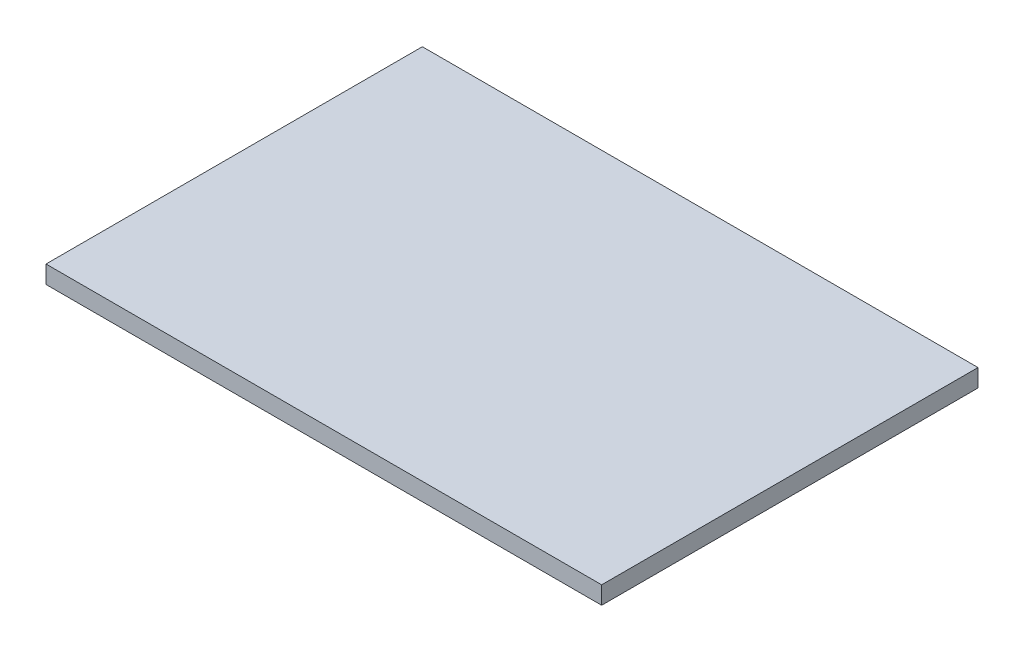
ISO-10303-21;
HEADER;
FILE_DESCRIPTION(('STEP AP214'),'2;1');
FILE_NAME('part.step','',(''),(''),'','','');
FILE_SCHEMA(('AUTOMOTIVE_DESIGN { 1 0 10303 214 1 1 1 1 }'));
ENDSEC;
DATA;
#1=APPLICATION_CONTEXT('core data for automotive mechanical design processes');
#2=APPLICATION_PROTOCOL_DEFINITION('international standard','automotive_design',2000,#1);
#3=PRODUCT_CONTEXT('',#1,'mechanical');
#4=PRODUCT('Part','Part','',(#3));
#5=PRODUCT_RELATED_PRODUCT_CATEGORY('part','',(#4));
#6=PRODUCT_DEFINITION_FORMATION('','',#4);
#7=PRODUCT_DEFINITION_CONTEXT('part definition',#1,'design');
#8=PRODUCT_DEFINITION('design','',#6,#7);
#9=PRODUCT_DEFINITION_SHAPE('','',#8);
#10=(LENGTH_UNIT() NAMED_UNIT(*) SI_UNIT(.MILLI.,.METRE.));
#11=(NAMED_UNIT(*) PLANE_ANGLE_UNIT() SI_UNIT($,.RADIAN.));
#12=(NAMED_UNIT(*) SI_UNIT($,.STERADIAN.) SOLID_ANGLE_UNIT());
#13=UNCERTAINTY_MEASURE_WITH_UNIT(LENGTH_MEASURE(1.E-05),#10,'distance_accuracy_value','');
#14=(GEOMETRIC_REPRESENTATION_CONTEXT(3) GLOBAL_UNCERTAINTY_ASSIGNED_CONTEXT((#13)) GLOBAL_UNIT_ASSIGNED_CONTEXT((#10,
#11,#12)) REPRESENTATION_CONTEXT('',''));
#15=CARTESIAN_POINT('',(0.,0.,0.));
#16=DIRECTION('',(0.,0.,1.));
#17=DIRECTION('',(1.,0.,0.));
#18=AXIS2_PLACEMENT_3D('',#15,#16,#17);
#19=CARTESIAN_POINT('',(141.,9.,-95.5));
#20=DIRECTION('',(-1.,0.,0.));
#21=DIRECTION('',(0.,0.,1.));
#22=AXIS2_PLACEMENT_3D('',#19,#20,#21);
#23=PLANE('',#22);
#24=DIRECTION('',(0.,0.,-1.));
#25=VECTOR('',#24,1.);
#26=CARTESIAN_POINT('',(141.,0.,-95.5));
#27=LINE('',#26,#25);
#28=CARTESIAN_POINT('',(141.,0.,95.5));
#29=VERTEX_POINT('',#28);
#30=CARTESIAN_POINT('',(141.,0.,-95.5));
#31=VERTEX_POINT('',#30);
#32=EDGE_CURVE('E108',#29,#31,#27,.T.);
#33=ORIENTED_EDGE('',*,*,#32,.T.);
#34=DIRECTION('',(0.,-1.,0.));
#35=VECTOR('',#34,1.);
#36=CARTESIAN_POINT('',(141.,9.,-95.5));
#37=LINE('',#36,#35);
#38=CARTESIAN_POINT('',(141.,9.,-95.5));
#39=VERTEX_POINT('',#38);
#40=EDGE_CURVE('E11',#39,#31,#37,.T.);
#41=ORIENTED_EDGE('',*,*,#40,.F.);
#42=DIRECTION('',(0.,0.,-1.));
#43=VECTOR('',#42,1.);
#44=CARTESIAN_POINT('',(141.,9.,-95.5));
#45=LINE('',#44,#43);
#46=CARTESIAN_POINT('',(141.,9.,95.5));
#47=VERTEX_POINT('',#46);
#48=EDGE_CURVE('E96',#47,#39,#45,.T.);
#49=ORIENTED_EDGE('',*,*,#48,.F.);
#50=DIRECTION('',(0.,-1.,0.));
#51=VECTOR('',#50,1.);
#52=CARTESIAN_POINT('',(141.,9.,95.5));
#53=LINE('',#52,#51);
#54=EDGE_CURVE('E104',#47,#29,#53,.T.);
#55=ORIENTED_EDGE('',*,*,#54,.T.);
#56=EDGE_LOOP('',(#33,#41,#49,#55));
#57=FACE_BOUND('',#56,.T.);
#58=ADVANCED_FACE('F45',(#57),#23,.F.);
#59=CARTESIAN_POINT('',(-141.,9.,-95.5));
#60=DIRECTION('',(0.,0.,1.));
#61=DIRECTION('',(1.,0.,0.));
#62=AXIS2_PLACEMENT_3D('',#59,#60,#61);
#63=PLANE('',#62);
#64=DIRECTION('',(-1.,0.,0.));
#65=VECTOR('',#64,1.);
#66=CARTESIAN_POINT('',(-141.,0.,-95.5));
#67=LINE('',#66,#65);
#68=CARTESIAN_POINT('',(-141.,0.,-95.5));
#69=VERTEX_POINT('',#68);
#70=EDGE_CURVE('E100',#31,#69,#67,.T.);
#71=ORIENTED_EDGE('',*,*,#70,.T.);
#72=DIRECTION('',(0.,-1.,0.));
#73=VECTOR('',#72,1.);
#74=CARTESIAN_POINT('',(-141.,9.,-95.5));
#75=LINE('',#74,#73);
#76=CARTESIAN_POINT('',(-141.,9.,-95.5));
#77=VERTEX_POINT('',#76);
#78=EDGE_CURVE('E53',#77,#69,#75,.T.);
#79=ORIENTED_EDGE('',*,*,#78,.F.);
#80=DIRECTION('',(-1.,0.,0.));
#81=VECTOR('',#80,1.);
#82=CARTESIAN_POINT('',(-141.,9.,-95.5));
#83=LINE('',#82,#81);
#84=EDGE_CURVE('E91',#39,#77,#83,.T.);
#85=ORIENTED_EDGE('',*,*,#84,.F.);
#86=ORIENTED_EDGE('',*,*,#40,.T.);
#87=EDGE_LOOP('',(#71,#79,#85,#86));
#88=FACE_BOUND('',#87,.T.);
#89=ADVANCED_FACE('F99',(#88),#63,.F.);
#90=CARTESIAN_POINT('',(-141.,9.,-95.5));
#91=DIRECTION('',(1.,0.,0.));
#92=DIRECTION('',(0.,0.,-1.));
#93=AXIS2_PLACEMENT_3D('',#90,#91,#92);
#94=PLANE('',#93);
#95=DIRECTION('',(0.,0.,1.));
#96=VECTOR('',#95,1.);
#97=CARTESIAN_POINT('',(-141.,0.,-95.5));
#98=LINE('',#97,#96);
#99=CARTESIAN_POINT('',(-141.,0.,95.5));
#100=VERTEX_POINT('',#99);
#101=EDGE_CURVE('E78',#69,#100,#98,.T.);
#102=ORIENTED_EDGE('',*,*,#101,.T.);
#103=DIRECTION('',(0.,-1.,0.));
#104=VECTOR('',#103,1.);
#105=CARTESIAN_POINT('',(-141.,9.,95.5));
#106=LINE('',#105,#104);
#107=CARTESIAN_POINT('',(-141.,9.,95.5));
#108=VERTEX_POINT('',#107);
#109=EDGE_CURVE('E101',#108,#100,#106,.T.);
#110=ORIENTED_EDGE('',*,*,#109,.F.);
#111=DIRECTION('',(0.,0.,1.));
#112=VECTOR('',#111,1.);
#113=CARTESIAN_POINT('',(-141.,9.,-95.5));
#114=LINE('',#113,#112);
#115=EDGE_CURVE('E94',#77,#108,#114,.T.);
#116=ORIENTED_EDGE('',*,*,#115,.F.);
#117=ORIENTED_EDGE('',*,*,#78,.T.);
#118=EDGE_LOOP('',(#102,#110,#116,#117));
#119=FACE_BOUND('',#118,.T.);
#120=ADVANCED_FACE('F102',(#119),#94,.F.);
#121=CARTESIAN_POINT('',(-141.,9.,95.5));
#122=DIRECTION('',(0.,0.,-1.));
#123=DIRECTION('',(-1.,0.,0.));
#124=AXIS2_PLACEMENT_3D('',#121,#122,#123);
#125=PLANE('',#124);
#126=DIRECTION('',(1.,0.,0.));
#127=VECTOR('',#126,1.);
#128=CARTESIAN_POINT('',(-141.,0.,95.5));
#129=LINE('',#128,#127);
#130=EDGE_CURVE('E84',#100,#29,#129,.T.);
#131=ORIENTED_EDGE('',*,*,#130,.T.);
#132=ORIENTED_EDGE('',*,*,#54,.F.);
#133=DIRECTION('',(1.,0.,0.));
#134=VECTOR('',#133,1.);
#135=CARTESIAN_POINT('',(-141.,9.,95.5));
#136=LINE('',#135,#134);
#137=EDGE_CURVE('E61',#108,#47,#136,.T.);
#138=ORIENTED_EDGE('',*,*,#137,.F.);
#139=ORIENTED_EDGE('',*,*,#109,.T.);
#140=EDGE_LOOP('',(#131,#132,#138,#139));
#141=FACE_BOUND('',#140,.T.);
#142=ADVANCED_FACE('F115',(#141),#125,.F.);
#143=CARTESIAN_POINT('',(0.,9.,0.));
#144=DIRECTION('',(0.,1.,0.));
#145=DIRECTION('',(0.,0.,1.));
#146=AXIS2_PLACEMENT_3D('',#143,#144,#145);
#147=PLANE('',#146);
#148=ORIENTED_EDGE('',*,*,#48,.T.);
#149=ORIENTED_EDGE('',*,*,#84,.T.);
#150=ORIENTED_EDGE('',*,*,#115,.T.);
#151=ORIENTED_EDGE('',*,*,#137,.T.);
#152=EDGE_LOOP('',(#148,#149,#150,#151));
#153=FACE_BOUND('',#152,.T.);
#154=ADVANCED_FACE('F92',(#153),#147,.T.);
#155=CARTESIAN_POINT('',(0.,0.,0.));
#156=DIRECTION('',(0.,1.,0.));
#157=DIRECTION('',(0.,0.,1.));
#158=AXIS2_PLACEMENT_3D('',#155,#156,#157);
#159=PLANE('',#158);
#160=ORIENTED_EDGE('',*,*,#32,.F.);
#161=ORIENTED_EDGE('',*,*,#130,.F.);
#162=ORIENTED_EDGE('',*,*,#101,.F.);
#163=ORIENTED_EDGE('',*,*,#70,.F.);
#164=EDGE_LOOP('',(#160,#161,#162,#163));
#165=FACE_BOUND('',#164,.T.);
#166=ADVANCED_FACE('F118',(#165),#159,.F.);
#167=CLOSED_SHELL('',(#58,#89,#120,#142,#154,#166));
#168=MANIFOLD_SOLID_BREP('B2',#167);
#169=ADVANCED_BREP_SHAPE_REPRESENTATION('',(#18,#168),#14);
#170=SHAPE_DEFINITION_REPRESENTATION(#9,#169);
ENDSEC;
END-ISO-10303-21;
